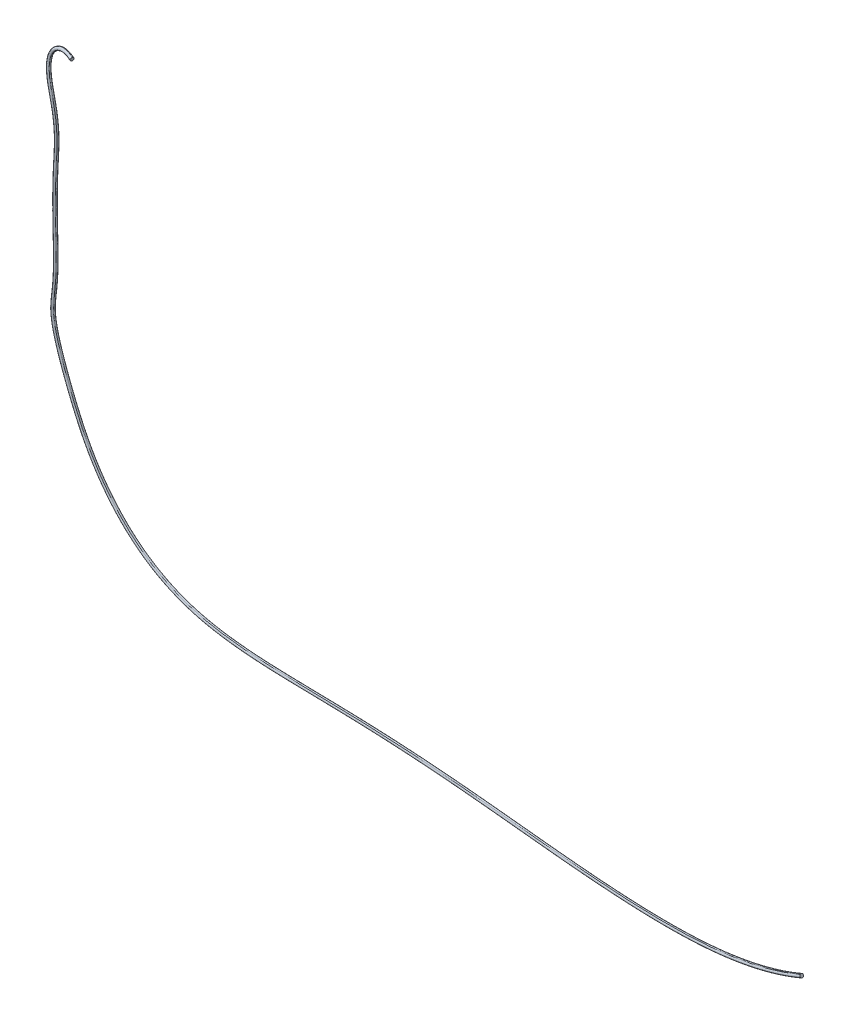
ISO-10303-21;
HEADER;
FILE_DESCRIPTION(('STEP AP214'),'2;1');
FILE_NAME('part.step','',(''),(''),'','','');
FILE_SCHEMA(('AUTOMOTIVE_DESIGN { 1 0 10303 214 1 1 1 1 }'));
ENDSEC;
DATA;
#1=APPLICATION_CONTEXT('core data for automotive mechanical design processes');
#2=APPLICATION_PROTOCOL_DEFINITION('international standard','automotive_design',2000,#1);
#3=PRODUCT_CONTEXT('',#1,'mechanical');
#4=PRODUCT('Part','Part','',(#3));
#5=PRODUCT_RELATED_PRODUCT_CATEGORY('part','',(#4));
#6=PRODUCT_DEFINITION_FORMATION('','',#4);
#7=PRODUCT_DEFINITION_CONTEXT('part definition',#1,'design');
#8=PRODUCT_DEFINITION('design','',#6,#7);
#9=PRODUCT_DEFINITION_SHAPE('','',#8);
#10=(LENGTH_UNIT() NAMED_UNIT(*) SI_UNIT(.MILLI.,.METRE.));
#11=(NAMED_UNIT(*) PLANE_ANGLE_UNIT() SI_UNIT($,.RADIAN.));
#12=(NAMED_UNIT(*) SI_UNIT($,.STERADIAN.) SOLID_ANGLE_UNIT());
#13=UNCERTAINTY_MEASURE_WITH_UNIT(LENGTH_MEASURE(1.E-05),#10,'distance_accuracy_value','');
#14=(GEOMETRIC_REPRESENTATION_CONTEXT(3) GLOBAL_UNCERTAINTY_ASSIGNED_CONTEXT((#13)) GLOBAL_UNIT_ASSIGNED_CONTEXT((#10,
#11,#12)) REPRESENTATION_CONTEXT('',''));
#15=CARTESIAN_POINT('',(0.,0.,0.));
#16=DIRECTION('',(0.,0.,1.));
#17=DIRECTION('',(1.,0.,0.));
#18=AXIS2_PLACEMENT_3D('',#15,#16,#17);
#19=CARTESIAN_POINT('',(-22.67164491039,-2.076760248952,3.80305513116));
#20=CARTESIAN_POINT('',(-22.95607167295,-2.014027692752,3.706750421331));
#21=CARTESIAN_POINT('',(-23.46844392967,-2.02623183959,3.574182860336));
#22=CARTESIAN_POINT('',(-24.03408862199,-2.531160033682,3.571536751872));
#23=CARTESIAN_POINT('',(-24.05401102016,-3.51724450732,3.605977552714));
#24=CARTESIAN_POINT('',(-23.74221789007,-4.752101948218,3.589555676561));
#25=CARTESIAN_POINT('',(-23.64083597459,-5.910531929845,3.579675558743));
#26=CARTESIAN_POINT('',(-23.74279220712,-7.209352522842,3.586840748665));
#27=CARTESIAN_POINT('',(-23.74862554347,-8.960165542116,3.592708134319));
#28=CARTESIAN_POINT('',(-23.69730884828,-10.45525250418,3.590397494064));
#29=CARTESIAN_POINT('',(-23.72172302127,-11.37035240823,3.588450071318));
#30=CARTESIAN_POINT('',(-23.78010994462,-11.99086446249,3.587492341004));
#31=CARTESIAN_POINT('',(-23.83745403419,-12.40256623798,3.587723189455));
#32=CARTESIAN_POINT('',(-23.83622269867,-12.99785602954,3.588432412043));
#33=CARTESIAN_POINT('',(-23.67091605847,-13.82444787645,3.588943682323));
#34=CARTESIAN_POINT('',(-23.22091522872,-15.09454296238,3.588379868286));
#35=CARTESIAN_POINT('',(-22.73235162434,-16.30401490197,3.587999459784));
#36=CARTESIAN_POINT('',(-22.21424490788,-17.40861278317,3.588102687776));
#37=CARTESIAN_POINT('',(-21.35286017171,-18.78205674564,3.588484438544));
#38=CARTESIAN_POINT('',(-19.89640919568,-20.3623578802,3.58846778894));
#39=CARTESIAN_POINT('',(-17.59550347406,-21.58672542901,3.588186994913));
#40=CARTESIAN_POINT('',(-14.90623070752,-21.97720202819,3.588145351308));
#41=CARTESIAN_POINT('',(-12.76873889252,-22.02462521936,3.588218505189));
#42=CARTESIAN_POINT('',(-11.56017834658,-22.04865538045,3.588262607791));
#43=CARTESIAN_POINT('',(-10.33317090661,-22.07295820868,3.588307626484));
#44=CARTESIAN_POINT('',(-8.236812459988,-22.13785565984,3.588375894807));
#45=CARTESIAN_POINT('',(-4.161177133769,-22.43001497404,3.588428890037));
#46=CARTESIAN_POINT('',(1.031748074186,-23.05646031213,3.588335469948));
#47=CARTESIAN_POINT('',(6.504269605505,-23.24818116139,3.588217498175));
#48=CARTESIAN_POINT('',(9.354727235141,-22.59186827282,3.588254799676));
#49=CARTESIAN_POINT('',(10.579136647261,-22.06811229371,3.588301979863));
#50=CARTESIAN_POINT('',(-22.6647656712,-2.07827751918,3.78174961065));
#51=CARTESIAN_POINT('',(-22.94992711645,-2.015382922944,3.685196142925));
#52=CARTESIAN_POINT('',(-23.46532689104,-2.027938551912,3.55198888539));
#53=CARTESIAN_POINT('',(-24.03091289757,-2.533756434532,3.549441751559));
#54=CARTESIAN_POINT('',(-24.05039175029,-3.516396233827,3.583780267348));
#55=CARTESIAN_POINT('',(-23.73899443894,-4.751192004521,3.56740793941));
#56=CARTESIAN_POINT('',(-23.63727654964,-5.910670701197,3.557502131695));
#57=CARTESIAN_POINT('',(-23.73936519231,-7.209740419677,3.564680007776));
#58=CARTESIAN_POINT('',(-23.74511162946,-8.960028080182,3.570541377373));
#59=CARTESIAN_POINT('',(-23.69382355444,-10.4551611806,3.568233888336));
#60=CARTESIAN_POINT('',(-23.71822626351,-11.3704722334,3.566285447746));
#61=CARTESIAN_POINT('',(-23.7766578732,-11.99131380137,3.565327194153));
#62=CARTESIAN_POINT('',(-23.8339538977,-12.40285860336,3.565559481804));
#63=CARTESIAN_POINT('',(-23.83273271403,-12.99740056786,3.566266821805));
#64=CARTESIAN_POINT('',(-23.66757927302,-13.82338834288,3.566778607334));
#65=CARTESIAN_POINT('',(-23.21765292408,-15.09331186014,3.566214381304));
#66=CARTESIAN_POINT('',(-22.7291537387,-16.30262139887,3.56583419668));
#67=CARTESIAN_POINT('',(-22.21116657602,-17.40695442166,3.565937343339));
#68=CARTESIAN_POINT('',(-21.35008485401,-18.77992379869,3.566319012379));
#69=CARTESIAN_POINT('',(-19.89420140401,-20.35957505319,3.566302325174));
#70=CARTESIAN_POINT('',(-17.59452633608,-21.58330808789,3.566021724759));
#71=CARTESIAN_POINT('',(-14.90602465761,-21.97371893581,3.56598003981));
#72=CARTESIAN_POINT('',(-12.76864251679,-22.0211344188,3.566053197157));
#73=CARTESIAN_POINT('',(-11.56008730719,-22.0451641354,3.566097301474));
#74=CARTESIAN_POINT('',(-10.33306660903,-22.06946648445,3.56614232008));
#75=CARTESIAN_POINT('',(-8.236623286719,-22.13436347391,3.566210591404));
#76=CARTESIAN_POINT('',(-4.160814768168,-22.42653700488,3.566263585155));
#77=CARTESIAN_POINT('',(1.032111219892,-23.05298262985,3.566170170229));
#78=CARTESIAN_POINT('',(6.504069578415,-23.24466014294,3.566052208966));
#79=CARTESIAN_POINT('',(9.353746364364,-22.58848103764,3.566089504875));
#80=CARTESIAN_POINT('',(10.57776083668,-22.06489399883,3.566136669844));
#81=CARTESIAN_POINT('',(-22.65572391391,-2.102286144986,3.739406507901));
#82=CARTESIAN_POINT('',(-22.93954103262,-2.039688050524,3.643308218779));
#83=CARTESIAN_POINT('',(-23.45196888145,-2.055237477646,3.511598568785));
#84=CARTESIAN_POINT('',(-24.00156128366,-2.545783708927,3.509303261196));
#85=CARTESIAN_POINT('',(-24.02244322247,-3.509098545804,3.542947066645));
#86=CARTESIAN_POINT('',(-23.71141206014,-4.745052826764,3.526877527273));
#87=CARTESIAN_POINT('',(-23.60879919661,-5.911715365266,3.516772992323));
#88=CARTESIAN_POINT('',(-23.711323521,-7.211838680627,3.524033026617));
#89=CARTESIAN_POINT('',(-23.71683365565,-8.958867633436,3.529843082395));
#90=CARTESIAN_POINT('',(-23.66567567006,-10.4546929113,3.527553199468));
#91=CARTESIAN_POINT('',(-23.69003166041,-11.37189382269,3.525595620575));
#92=CARTESIAN_POINT('',(-23.74879731543,-11.99540196741,3.524632562332));
#93=CARTESIAN_POINT('',(-23.80571585862,-12.4054422124,3.524876032812));
#94=CARTESIAN_POINT('',(-23.8045268419,-12.99354770533,3.525567039427));
#95=CARTESIAN_POINT('',(-23.64067672477,-13.81462428108,3.526082942345));
#96=CARTESIAN_POINT('',(-23.19122597661,-15.08340767276,3.52551464623));
#97=CARTESIAN_POINT('',(-22.70322489417,-16.29146261047,3.525136189324));
#98=CARTESIAN_POINT('',(-22.18620294989,-17.39359334745,3.525238499012));
#99=CARTESIAN_POINT('',(-21.32764543868,-18.76258851778,3.525619428238));
#100=CARTESIAN_POINT('',(-19.87616209779,-20.33704239279,3.52560230753));
#101=CARTESIAN_POINT('',(-17.58662495616,-21.55562172907,3.525323317776));
#102=CARTESIAN_POINT('',(-14.90460987429,-21.94554364271,3.525281255842));
#103=CARTESIAN_POINT('',(-12.76808368829,-21.99293833426,3.525354434837));
#104=CARTESIAN_POINT('',(-11.55955651415,-22.01697103469,3.525398552663));
#105=CARTESIAN_POINT('',(-10.33240530433,-22.04127621106,3.525443568987));
#106=CARTESIAN_POINT('',(-8.235168134155,-22.1061951864,3.525511860614));
#107=CARTESIAN_POINT('',(-4.157848743711,-22.39849083855,3.525564841186));
#108=CARTESIAN_POINT('',(1.035251416696,-23.02495175228,3.525471463482));
#109=CARTESIAN_POINT('',(6.502495591705,-23.2162360268,3.525353593663));
#110=CARTESIAN_POINT('',(9.346093997349,-22.56109287054,3.525390844582));
#111=CARTESIAN_POINT('',(10.566675035502,-22.03897452484,3.52543787725));
#112=CARTESIAN_POINT('',(-22.66622939134,-2.174279040754,3.723537507868));
#113=CARTESIAN_POINT('',(-22.94137851729,-2.113592740168,3.630374134295));
#114=CARTESIAN_POINT('',(-23.42567926371,-2.136373850236,3.507411771746));
#115=CARTESIAN_POINT('',(-23.92245951406,-2.570986106869,3.505451820853));
#116=CARTESIAN_POINT('',(-23.95036348209,-3.490800446454,3.537430688435));
#117=CARTESIAN_POINT('',(-23.63791032053,-4.730513695952,3.522098789187));
#118=CARTESIAN_POINT('',(-23.53415008269,-5.914510529335,3.51150913431));
#119=CARTESIAN_POINT('',(-23.63728601238,-7.216579509843,3.518969724229));
#120=CARTESIAN_POINT('',(-23.64244829702,-8.955884393093,3.524655037433));
#121=CARTESIAN_POINT('',(-23.59152921295,-10.45362832824,3.522408355163));
#122=CARTESIAN_POINT('',(-23.61579261818,-11.37578329947,3.520427631149));
#123=CARTESIAN_POINT('',(-23.67539996903,-12.00607492033,3.519452128411));
#124=CARTESIAN_POINT('',(-23.73137276045,-12.41198767815,3.519724866263));
#125=CARTESIAN_POINT('',(-23.73024300839,-12.98330259149,3.520373242425));
#126=CARTESIAN_POINT('',(-23.56979999529,-13.79165729723,3.520900024139));
#127=CARTESIAN_POINT('',(-23.12160811255,-15.05735775857,3.520321076372));
#128=CARTESIAN_POINT('',(-22.63495781088,-16.26204866723,3.519947176831));
#129=CARTESIAN_POINT('',(-22.12050133587,-17.35834821536,3.520047301095));
#130=CARTESIAN_POINT('',(-21.26855662635,-18.71695215223,3.520426308657));
#131=CARTESIAN_POINT('',(-19.82870624314,-20.27771864315,3.520408064472));
#132=CARTESIAN_POINT('',(-17.56580685077,-21.48272995116,3.520133285883));
#133=CARTESIAN_POINT('',(-14.90079114882,-21.87134534313,3.520090244241));
#134=CARTESIAN_POINT('',(-12.76653367828,-21.918669749,3.520163480777));
#135=CARTESIAN_POINT('',(-11.55808617778,-21.9427079064,3.520207634062));
#136=CARTESIAN_POINT('',(-10.33059991212,-21.96701795457,3.520252644698));
#137=CARTESIAN_POINT('',(-8.231311101068,-22.03198509773,3.520320990309));
#138=CARTESIAN_POINT('',(-4.150050283847,-22.32459982371,3.520373936684));
#139=CARTESIAN_POINT('',(1.043448045457,-22.95109682433,3.520280657338));
#140=CARTESIAN_POINT('',(6.498335490767,-23.14136126913,3.520163026255));
#141=CARTESIAN_POINT('',(9.325832068386,-22.48896444578,3.520200158133));
#142=CARTESIAN_POINT('',(10.537459721249,-21.97067601925,3.5202468458));
#143=CARTESIAN_POINT('',(-22.69306328881,-2.228147991816,3.767698812032));
#144=CARTESIAN_POINT('',(-22.95936484592,-2.169413092022,3.677531157083));
#145=CARTESIAN_POINT('',(-23.41295869552,-2.196840232214,3.563272993643));
#146=CARTESIAN_POINT('',(-23.86764596202,-2.584379440099,3.561346969225));
#147=CARTESIAN_POINT('',(-23.9022632581,-3.478718726546,3.592280652014));
#148=CARTESIAN_POINT('',(-23.58751559817,-4.721465669557,3.577415686229));
#149=CARTESIAN_POINT('',(-23.48368122541,-5.916418494834,3.566514945501));
#150=CARTESIAN_POINT('',(-23.58693479198,-7.219353008066,3.574103107841));
#151=CARTESIAN_POINT('',(-23.59202497942,-8.953885040099,3.579708405829));
#152=CARTESIAN_POINT('',(-23.54121163527,-10.45300746987,3.577489121184));
#153=CARTESIAN_POINT('',(-23.56542973727,-11.37853595596,3.575493036247));
#154=CARTESIAN_POINT('',(-23.62558924058,-12.01333231036,3.574509131863));
#155=CARTESIAN_POINT('',(-23.68094099491,-12.41634832836,3.574801689848));
#156=CARTESIAN_POINT('',(-23.67983515166,-12.97628993363,3.575421163856));
#157=CARTESIAN_POINT('',(-23.52170105276,-13.77609592501,3.575955375608));
#158=CARTESIAN_POINT('',(-23.0743511209,-15.03969986654,3.575369173018));
#159=CARTESIAN_POINT('',(-22.58863080001,-16.24208993824,3.574998379885));
#160=CARTESIAN_POINT('',(-22.07592475077,-17.33441239001,3.575097017095));
#161=CARTESIAN_POINT('',(-21.2284617186,-18.68597987287,3.575474726258));
#162=CARTESIAN_POINT('',(-19.7965020735,-20.23746481837,3.575455720138));
#163=CARTESIAN_POINT('',(-17.55167569165,-21.43326798667,3.575183796202));
#164=CARTESIAN_POINT('',(-14.89819066839,-21.82099393743,3.575140091072));
#165=CARTESIAN_POINT('',(-12.76547515804,-21.86826906639,3.575213366647));
#166=CARTESIAN_POINT('',(-11.55708237794,-21.89231070059,3.575257543977));
#167=CARTESIAN_POINT('',(-10.32936960333,-21.91662377152,3.575302550786));
#168=CARTESIAN_POINT('',(-8.228692130526,-21.98162257439,3.575370933089));
#169=CARTESIAN_POINT('',(-4.144759293007,-22.27445361058,3.575423856329));
#170=CARTESIAN_POINT('',(1.049003779901,-22.9009748848,3.575330643718));
#171=CARTESIAN_POINT('',(6.495511316382,-23.09054880507,3.575213174446));
#172=CARTESIAN_POINT('',(9.312069659925,-22.44001780397,3.575250225469));
#173=CARTESIAN_POINT('',(10.517630236508,-21.92432464292,3.575296679353));
#174=CARTESIAN_POINT('',(-22.70824732937,-2.22468128383333,3.81480162726868));
#175=CARTESIAN_POINT('',(-22.9729799494667,-2.16629242541933,3.72516520230234));
#176=CARTESIAN_POINT('',(-23.41992156906,-2.192804478578,3.61228674599634));
#177=CARTESIAN_POINT('',(-23.8749569347133,-2.57861622417633,3.61015370211101));
#178=CARTESIAN_POINT('',(-23.9104848201533,-3.480830689012,3.64132747431868));
#179=CARTESIAN_POINT('',(-23.59481632317,-4.723623146325,3.62635360793701));
#180=CARTESIAN_POINT('',(-23.4917051312767,-5.91612316087,3.61551568576101));
#181=CARTESIAN_POINT('',(-23.5946538182467,-7.21848362722267,3.62307530705501));
#182=CARTESIAN_POINT('',(-23.5999254818933,-8.954212147035,3.62869614071568));
#183=CARTESIAN_POINT('',(-23.5490437216967,-10.4532062818767,3.62647023688468));
#184=CARTESIAN_POINT('',(-23.5732867805567,-11.3782332275267,3.62447670288168));
#185=CARTESIAN_POINT('',(-23.6333430414533,-12.0122494417867,3.62349408071968));
#186=CARTESIAN_POINT('',(-23.6888093474633,-12.4156213044733,3.62378342707801));
#187=CARTESIAN_POINT('',(-23.6876828115933,-12.9773197642433,3.62440733712334));
#188=CARTESIAN_POINT('',(-23.5291919457133,-13.77852214171,3.62494040100468));
#189=CARTESIAN_POINT('',(-23.0816914097533,-15.0424679603333,3.62435522795134));
#190=CARTESIAN_POINT('',(-22.5958353727233,-16.24520625082,3.62398394237101));
#191=CARTESIAN_POINT('',(-22.08286441535,-17.3381269626233,3.62408278786101));
#192=CARTESIAN_POINT('',(-21.2347049023533,-18.69079120535,3.62446069499268));
#193=CARTESIAN_POINT('',(-19.8014997505733,-20.24373069591,3.62444179246068));
#194=CARTESIAN_POINT('',(-17.55387201389,-21.4409646546767,3.62416942233734));
#195=CARTESIAN_POINT('',(-14.89860756061,-21.8288300762367,3.62412581765601));
#196=CARTESIAN_POINT('',(-12.7656515902267,-21.8761148166967,3.62419908631101));
#197=CARTESIAN_POINT('',(-11.55724964946,-21.9001562365767,3.62424325980701));
#198=CARTESIAN_POINT('',(-10.3295710208833,-21.92446912766,3.62428826706068));
#199=CARTESIAN_POINT('',(-8.22910426111733,-21.98946416619,3.62435664318768));
#200=CARTESIAN_POINT('',(-4.14558090767633,-22.28226191556,3.62440956998901));
#201=CARTESIAN_POINT('',(1.048149549775,-22.90878024106,3.62431634638001));
#202=CARTESIAN_POINT('',(6.49595335919133,-23.09845956315,3.62419885232134));
#203=CARTESIAN_POINT('',(9.314223220627,-22.4476363325367,3.62423591580034));
#204=CARTESIAN_POINT('',(10.5207165850267,-21.93154416018,3.62428240562768));
#205=CARTESIAN_POINT('',(-22.7123421208817,-2.21382729884266,3.83396545133918));
#206=CARTESIAN_POINT('',(-22.9776690036117,-2.15530737113782,3.74412781362485));
#207=CARTESIAN_POINT('',(-23.42595517171,-2.18050891088849,3.63057937172468));
#208=CARTESIAN_POINT('',(-23.8881736558417,-2.57317452354566,3.62832876750135));
#209=CARTESIAN_POINT('',(-23.9230864149717,-3.48405867141717,3.65981279548468));
#210=CARTESIAN_POINT('',(-23.607268105765,-4.726356360004,3.64470163866435));
#211=CARTESIAN_POINT('',(-23.5045681055183,-5.915645541099,3.63395185396085));
#212=CARTESIAN_POINT('',(-23.607323571055,-7.21753673347883,3.64147442872235));
#213=CARTESIAN_POINT('',(-23.61270556389,-8.95473045523417,3.64711781393985));
#214=CARTESIAN_POINT('',(-23.561766496005,-10.453419654595,3.64488383426868));
#215=CARTESIAN_POINT('',(-23.5860308205167,-11.377601471255,3.64289434665868));
#216=CARTESIAN_POINT('',(-23.6459371278717,-12.0104262796583,3.64191386228118));
#217=CARTESIAN_POINT('',(-23.70157169412,-12.4144775856217,3.64219815495318));
#218=CARTESIAN_POINT('',(-23.70042998294,-12.97905939329,3.64282937778685));
#219=CARTESIAN_POINT('',(-23.5413542400433,-13.782468031405,3.64336058068602));
#220=CARTESIAN_POINT('',(-23.0936331150183,-15.04694394329,3.64277721536518));
#221=CARTESIAN_POINT('',(-22.6075488097383,-16.2502550334633,3.64240514712468));
#222=CARTESIAN_POINT('',(-22.0941402647917,-17.344170215735,3.64250436318035));
#223=CARTESIAN_POINT('',(-21.2448451080317,-18.6986204670367,3.64288260020118));
#224=CARTESIAN_POINT('',(-19.809641084695,-20.253911071445,3.64286388791568));
#225=CARTESIAN_POINT('',(-17.557443214405,-21.453472798865,3.64259079395935));
#226=CARTESIAN_POINT('',(-14.8992626552717,-21.8415620253433,3.64254735720368));
#227=CARTESIAN_POINT('',(-12.7659177637117,-21.8888587745017,3.64262061582968));
#228=CARTESIAN_POINT('',(-11.5575021920367,-21.91289925645,3.64266478321968));
#229=CARTESIAN_POINT('',(-10.3298810796667,-21.93721129532,3.64270979142852));
#230=CARTESIAN_POINT('',(-8.22976636731133,-22.0021980228267,3.64277815821552));
#231=CARTESIAN_POINT('',(-4.14691905065733,-22.29494102774,3.64283109089268));
#232=CARTESIAN_POINT('',(1.04674313086317,-22.9214532219817,3.64273785029218));
#233=CARTESIAN_POINT('',(6.49666730978017,-23.1113075697567,3.64262031528868));
#234=CARTESIAN_POINT('',(9.31769918127767,-22.46001325068,3.64265739915268));
#235=CARTESIAN_POINT('',(10.5257290938122,-21.9432638012183,3.64270394818802));
#236=B_SPLINE_SURFACE_WITH_KNOTS('',3,3,((#19,#20,#21,#22,#23,#24,#25,#26,#27,#28,#29,#30,#31,
#32,#33,#34,#35,#36,#37,#38,#39,#40,#41,#42,#43,#44,#45,#46,#47,#48,#49),(#50,#51,#52,#53,#54,
#55,#56,#57,#58,#59,#60,#61,#62,#63,#64,#65,#66,#67,#68,#69,#70,#71,#72,#73,#74,#75,#76,#77,#78,
#79,#80),(#81,#82,#83,#84,#85,#86,#87,#88,#89,#90,#91,#92,#93,#94,#95,#96,#97,#98,#99,#100,#101,
#102,#103,#104,#105,#106,#107,#108,#109,#110,#111),(#112,#113,#114,#115,#116,#117,#118,#119,
#120,#121,#122,#123,#124,#125,#126,#127,#128,#129,#130,#131,#132,#133,#134,#135,#136,#137,#138,
#139,#140,#141,#142),(#143,#144,#145,#146,#147,#148,#149,#150,#151,#152,#153,#154,#155,#156,
#157,#158,#159,#160,#161,#162,#163,#164,#165,#166,#167,#168,#169,#170,#171,#172,#173),(#174,
#175,#176,#177,#178,#179,#180,#181,#182,#183,#184,#185,#186,#187,#188,#189,#190,#191,#192,#193,
#194,#195,#196,#197,#198,#199,#200,#201,#202,#203,#204),(#205,#206,#207,#208,#209,#210,#211,
#212,#213,#214,#215,#216,#217,#218,#219,#220,#221,#222,#223,#224,#225,#226,#227,#228,#229,#230,
#231,#232,#233,#234,#235)),.UNSPECIFIED.,.F.,.F.,.F.,(4,1,1,1,4),(4,1,1,1,1,1,1,1,1,1,1,1,1,1,1,
1,1,1,1,1,1,1,1,1,1,1,1,1,4),(-3.14159265359,-2.243994752564,-1.346396851538,-0.448798950513,
0.448798950513),(0.,0.03571428571429,0.07142857142857,0.107142857143,0.142857142857,
0.178571428571,0.214285714286,0.25,0.285714285714,0.303571428571,0.321428571429,0.348214285714,
0.357142857143,0.392857142857,0.428571428571,0.452380952381,0.488095238095,0.52380952381,
0.571428571429,0.619047619048,0.666666666667,0.702380952381,0.708333333333,0.714285714286,0.75,
0.785714285714,0.857142857143,0.928571428571,1.),.UNSPECIFIED.);
#237=CARTESIAN_POINT('',(-22.67164491039,-2.076760248952,3.80305513116));
#238=CARTESIAN_POINT('',(-22.95607167295,-2.014027692752,3.706750421331));
#239=CARTESIAN_POINT('',(-23.46844392967,-2.02623183959,3.574182860336));
#240=CARTESIAN_POINT('',(-24.03408862199,-2.531160033682,3.571536751872));
#241=CARTESIAN_POINT('',(-24.05401102016,-3.51724450732,3.605977552714));
#242=CARTESIAN_POINT('',(-23.74221789007,-4.752101948218,3.589555676561));
#243=CARTESIAN_POINT('',(-23.64083597459,-5.910531929845,3.579675558743));
#244=CARTESIAN_POINT('',(-23.74279220712,-7.209352522842,3.586840748665));
#245=CARTESIAN_POINT('',(-23.74862554347,-8.960165542116,3.592708134319));
#246=CARTESIAN_POINT('',(-23.69730884828,-10.45525250418,3.590397494064));
#247=CARTESIAN_POINT('',(-23.72172302127,-11.37035240823,3.588450071318));
#248=CARTESIAN_POINT('',(-23.78010994462,-11.99086446249,3.587492341004));
#249=CARTESIAN_POINT('',(-23.83745403419,-12.40256623798,3.587723189455));
#250=CARTESIAN_POINT('',(-23.83622269867,-12.99785602954,3.588432412043));
#251=CARTESIAN_POINT('',(-23.67091605847,-13.82444787645,3.588943682323));
#252=CARTESIAN_POINT('',(-23.22091522872,-15.09454296238,3.588379868286));
#253=CARTESIAN_POINT('',(-22.73235162434,-16.30401490197,3.587999459784));
#254=CARTESIAN_POINT('',(-22.21424490788,-17.40861278317,3.588102687776));
#255=CARTESIAN_POINT('',(-21.35286017171,-18.78205674564,3.588484438544));
#256=CARTESIAN_POINT('',(-19.89640919568,-20.3623578802,3.58846778894));
#257=CARTESIAN_POINT('',(-17.59550347406,-21.58672542901,3.588186994913));
#258=CARTESIAN_POINT('',(-14.90623070752,-21.97720202819,3.588145351308));
#259=CARTESIAN_POINT('',(-12.76873889252,-22.02462521936,3.588218505189));
#260=CARTESIAN_POINT('',(-11.56017834658,-22.04865538045,3.588262607791));
#261=CARTESIAN_POINT('',(-10.33317090661,-22.07295820868,3.588307626484));
#262=CARTESIAN_POINT('',(-8.236812459988,-22.13785565984,3.588375894807));
#263=CARTESIAN_POINT('',(-4.161177133769,-22.43001497404,3.588428890037));
#264=CARTESIAN_POINT('',(1.031748074186,-23.05646031213,3.588335469948));
#265=CARTESIAN_POINT('',(6.504269605505,-23.24818116139,3.588217498175));
#266=CARTESIAN_POINT('',(9.354727235141,-22.59186827282,3.588254799676));
#267=CARTESIAN_POINT('',(10.579136647261,-22.06811229371,3.588301979863));
#268=B_SPLINE_CURVE_WITH_KNOTS('',3,(#237,#238,#239,#240,#241,#242,#243,#244,#245,#246,#247,
#248,#249,#250,#251,#252,#253,#254,#255,#256,#257,#258,#259,#260,#261,#262,#263,#264,#265,#266,
#267),.UNSPECIFIED.,.F.,.F.,(4,1,1,1,1,1,1,1,1,1,1,1,1,1,1,1,1,1,1,1,1,1,1,1,1,1,1,1,4),(0.,
0.03571428571429,0.07142857142857,0.107142857143,0.142857142857,0.178571428571,0.214285714286,
0.25,0.285714285714,0.303571428571,0.321428571429,0.348214285714,0.357142857143,0.392857142857,
0.428571428571,0.452380952381,0.488095238095,0.52380952381,0.571428571429,0.619047619048,
0.666666666667,0.702380952381,0.708333333333,0.714285714286,0.75,0.785714285714,0.857142857143,
0.928571428571,1.),.UNSPECIFIED.);
#269=CARTESIAN_POINT('',(-22.6716449103886,-2.0767602489523,3.80305513116046));
#270=VERTEX_POINT('',#269);
#271=CARTESIAN_POINT('',(10.5791366472605,-22.0681122937102,3.588301979863));
#272=VERTEX_POINT('',#271);
#273=EDGE_CURVE('E11',#270,#272,#268,.T.);
#274=CARTESIAN_POINT('',(-22.671644910392,-2.07676024895155,3.80305513115931));
#275=CARTESIAN_POINT('',(-22.6690569843641,-2.07733340779941,3.79503858511437));
#276=CARTESIAN_POINT('',(-22.6667910631493,-2.07939934278363,3.78700066029199));
#277=CARTESIAN_POINT('',(-22.6631212237183,-2.08602409697569,3.77184679796066));
#278=CARTESIAN_POINT('',(-22.6617157545192,-2.09057840262195,3.76472921989008));
#279=CARTESIAN_POINT('',(-22.660352685312,-2.0990145317383,3.75520825975499));
#280=CARTESIAN_POINT('',(-22.6600236931459,-2.10216066724106,3.75218723100457));
#281=CARTESIAN_POINT('',(-22.6596679100614,-2.10893466272886,3.74672390231891));
#282=CARTESIAN_POINT('',(-22.6596409252525,-2.11256221212905,3.74428123206009));
#283=CARTESIAN_POINT('',(-22.6599801295803,-2.12343483722909,3.73820064908412));
#284=CARTESIAN_POINT('',(-22.6607038515786,-2.13111135289802,3.7353376370431));
#285=CARTESIAN_POINT('',(-22.6630984673696,-2.14732387635054,3.73184912416034));
#286=CARTESIAN_POINT('',(-22.6648233548996,-2.15588383422302,3.73136748765765));
#287=CARTESIAN_POINT('',(-22.6680470549317,-2.16827065890773,3.73281964290952));
#288=CARTESIAN_POINT('',(-22.6692276023714,-2.17232387573716,3.73366602555652));
#289=CARTESIAN_POINT('',(-22.6717678112952,-2.18015627229803,3.73606629386562));
#290=CARTESIAN_POINT('',(-22.6731275799445,-2.18393528595677,3.73762060420935));
#291=CARTESIAN_POINT('',(-22.6772388700805,-2.19432796857965,3.74299314928405));
#292=CARTESIAN_POINT('',(-22.6801553679879,-2.20048396230998,3.74759675420447));
#293=CARTESIAN_POINT('',(-22.6863927450769,-2.21131225697541,3.75896473787967));
#294=CARTESIAN_POINT('',(-22.6897274794365,-2.21583435104345,3.76586788081438));
#295=CARTESIAN_POINT('',(-22.6959952321224,-2.2216828171642,3.78056941906695));
#296=CARTESIAN_POINT('',(-22.6989401639342,-2.22316529371141,3.78830131379623));
#297=CARTESIAN_POINT('',(-22.7043445461833,-2.22353153327081,3.80402407341681));
#298=CARTESIAN_POINT('',(-22.7068015857348,-2.22240272359602,3.81201600779216));
#299=CARTESIAN_POINT('',(-22.7099639456811,-2.21874200197428,3.82374031733));
#300=CARTESIAN_POINT('',(-22.7109479481715,-2.21712703785721,3.82769845677674));
#301=CARTESIAN_POINT('',(-22.7126565322436,-2.2131920564274,3.83530782999541));
#302=CARTESIAN_POINT('',(-22.7133812493234,-2.21087240854567,3.83895922330192));
#303=CARTESIAN_POINT('',(-22.7150700957683,-2.20336174826144,3.84883948819604));
#304=CARTESIAN_POINT('',(-22.7156994439288,-2.19742219818203,3.85456721034776));
#305=CARTESIAN_POINT('',(-22.7160090146291,-2.18373830826253,3.8643951365794));
#306=CARTESIAN_POINT('',(-22.7156316240257,-2.17590878485806,3.86838067402234));
#307=CARTESIAN_POINT('',(-22.7142267931339,-2.16367170613735,3.87220283111291));
#308=CARTESIAN_POINT('',(-22.7136245290144,-2.15953564181863,3.87311831962931));
#309=CARTESIAN_POINT('',(-22.7121624861408,-2.15121139234483,3.87422270306793));
#310=CARTESIAN_POINT('',(-22.7113025253994,-2.14702317236707,3.8744110831912));
#311=CARTESIAN_POINT('',(-22.7085094813304,-2.13502774930132,3.8739758715147));
#312=CARTESIAN_POINT('',(-22.7063010128511,-2.12730469367546,3.87248414263551));
#313=CARTESIAN_POINT('',(-22.7011268266288,-2.11224381722359,3.8670132808566));
#314=CARTESIAN_POINT('',(-22.6981134551021,-2.10499124433281,3.86283787684491));
#315=CARTESIAN_POINT('',(-22.6919312061816,-2.09302079566788,3.85237670413136));
#316=CARTESIAN_POINT('',(-22.6887766194361,-2.08819844700267,3.84620119477558));
#317=CARTESIAN_POINT('',(-22.6825307169554,-2.08088287090428,3.83251985940018));
#318=CARTESIAN_POINT('',(-22.6794399165469,-2.07840431100242,3.82500600096965));
#319=CARTESIAN_POINT('',(-22.6748336912695,-2.07660612151229,3.81257328899595));
#320=CARTESIAN_POINT('',(-22.6731824689559,-2.07641971939797,3.80781798330075));
#321=CARTESIAN_POINT('',(-22.671644910392,-2.07676024895155,3.80305513115931));
#322=B_SPLINE_CURVE_WITH_KNOTS('',3,(#274,#275,#276,#277,#278,#279,#280,#281,#282,#283,#284,
#285,#286,#287,#288,#289,#290,#291,#292,#293,#294,#295,#296,#297,#298,#299,#300,#301,#302,#303,
#304,#305,#306,#307,#308,#309,#310,#311,#312,#313,#314,#315,#316,#317,#318,#319,#320,#321),
.UNSPECIFIED.,.T.,.F.,(4,2,2,2,2,2,2,2,2,2,2,2,2,2,2,2,2,2,2,2,2,2,2,4),(0.,0.0252781468673808,
0.0505105941444672,0.0635691326386559,0.0766192869867806,0.100876105381445,0.126581816495082,
0.13943328818076,0.152292479563436,0.176553796720393,0.202677880973782,0.227422832252827,
0.252287172061896,0.265383304272354,0.278472582638774,0.302879199911088,0.328712065216855,
0.341482877938606,0.354262730848094,0.378375038820849,0.404489670634637,0.429357648828761,
0.454380241606411,0.46939868911034),.UNSPECIFIED.);
#323=CARTESIAN_POINT('',(-22.7123421208828,-2.21382729884242,3.83396545133882));
#324=VERTEX_POINT('',#323);
#325=EDGE_CURVE('E47',#270,#324,#322,.T.);
#326=CARTESIAN_POINT('',(-22.7123421208817,-2.21382729884266,3.83396545133918));
#327=CARTESIAN_POINT('',(-22.9776690036117,-2.15530737113782,3.74412781362485));
#328=CARTESIAN_POINT('',(-23.42595517171,-2.18050891088849,3.63057937172468));
#329=CARTESIAN_POINT('',(-23.8881736558417,-2.57317452354566,3.62832876750135));
#330=CARTESIAN_POINT('',(-23.9230864149717,-3.48405867141717,3.65981279548468));
#331=CARTESIAN_POINT('',(-23.607268105765,-4.726356360004,3.64470163866435));
#332=CARTESIAN_POINT('',(-23.5045681055183,-5.915645541099,3.63395185396085));
#333=CARTESIAN_POINT('',(-23.607323571055,-7.21753673347883,3.64147442872235));
#334=CARTESIAN_POINT('',(-23.61270556389,-8.95473045523417,3.64711781393985));
#335=CARTESIAN_POINT('',(-23.561766496005,-10.453419654595,3.64488383426868));
#336=CARTESIAN_POINT('',(-23.5860308205167,-11.377601471255,3.64289434665868));
#337=CARTESIAN_POINT('',(-23.6459371278717,-12.0104262796583,3.64191386228118));
#338=CARTESIAN_POINT('',(-23.70157169412,-12.4144775856217,3.64219815495318));
#339=CARTESIAN_POINT('',(-23.70042998294,-12.97905939329,3.64282937778685));
#340=CARTESIAN_POINT('',(-23.5413542400433,-13.782468031405,3.64336058068602));
#341=CARTESIAN_POINT('',(-23.0936331150183,-15.04694394329,3.64277721536518));
#342=CARTESIAN_POINT('',(-22.6075488097383,-16.2502550334633,3.64240514712468));
#343=CARTESIAN_POINT('',(-22.0941402647917,-17.344170215735,3.64250436318035));
#344=CARTESIAN_POINT('',(-21.2448451080317,-18.6986204670367,3.64288260020118));
#345=CARTESIAN_POINT('',(-19.809641084695,-20.253911071445,3.64286388791568));
#346=CARTESIAN_POINT('',(-17.557443214405,-21.453472798865,3.64259079395935));
#347=CARTESIAN_POINT('',(-14.8992626552717,-21.8415620253433,3.64254735720368));
#348=CARTESIAN_POINT('',(-12.7659177637117,-21.8888587745017,3.64262061582968));
#349=CARTESIAN_POINT('',(-11.5575021920367,-21.91289925645,3.64266478321968));
#350=CARTESIAN_POINT('',(-10.3298810796667,-21.93721129532,3.64270979142852));
#351=CARTESIAN_POINT('',(-8.22976636731133,-22.0021980228267,3.64277815821552));
#352=CARTESIAN_POINT('',(-4.14691905065733,-22.29494102774,3.64283109089268));
#353=CARTESIAN_POINT('',(1.04674313086317,-22.9214532219817,3.64273785029218));
#354=CARTESIAN_POINT('',(6.49666730978017,-23.1113075697567,3.64262031528868));
#355=CARTESIAN_POINT('',(9.31769918127767,-22.46001325068,3.64265739915268));
#356=CARTESIAN_POINT('',(10.5257290938122,-21.9432638012183,3.64270394818802));
#357=B_SPLINE_CURVE_WITH_KNOTS('',3,(#326,#327,#328,#329,#330,#331,#332,#333,#334,#335,#336,
#337,#338,#339,#340,#341,#342,#343,#344,#345,#346,#347,#348,#349,#350,#351,#352,#353,#354,#355,
#356),.UNSPECIFIED.,.F.,.F.,(4,1,1,1,1,1,1,1,1,1,1,1,1,1,1,1,1,1,1,1,1,1,1,1,1,1,1,1,4),(0.,
0.03571428571429,0.07142857142857,0.107142857143,0.142857142857,0.178571428571,0.214285714286,
0.25,0.285714285714,0.303571428571,0.321428571429,0.348214285714,0.357142857143,0.392857142857,
0.428571428571,0.452380952381,0.488095238095,0.52380952381,0.571428571429,0.619047619048,
0.666666666667,0.702380952381,0.708333333333,0.714285714286,0.75,0.785714285714,0.857142857143,
0.928571428571,1.),.UNSPECIFIED.);
#358=CARTESIAN_POINT('',(10.5257290938124,-21.9432638012182,3.64270394818801));
#359=VERTEX_POINT('',#358);
#360=EDGE_CURVE('E29',#324,#359,#357,.T.);
#361=CARTESIAN_POINT('',(10.5791366472617,-22.0681122937097,3.588301979863));
#362=CARTESIAN_POINT('',(10.5796529655039,-22.0693200662152,3.59663505715971));
#363=CARTESIAN_POINT('',(10.5795783868915,-22.069146494308,3.6052282450295));
#364=CARTESIAN_POINT('',(10.5783520260328,-22.0662810704335,3.62186425067081));
#365=CARTESIAN_POINT('',(10.5772021830185,-22.0635937519885,3.6299080312781));
#366=CARTESIAN_POINT('',(10.5747333778034,-22.0578233111012,3.64104458911413));
#367=CARTESIAN_POINT('',(10.573763479422,-22.055556258395,3.64465408157952));
#368=CARTESIAN_POINT('',(10.5715792738192,-22.0504507402863,3.65135737334516));
#369=CARTESIAN_POINT('',(10.5703651165643,-22.0476126254962,3.65445148694985));
#370=CARTESIAN_POINT('',(10.5666028607748,-22.0388181426985,3.6624729141239));
#371=CARTESIAN_POINT('',(10.5638096477807,-22.0322886930743,3.66666955833956));
#372=CARTESIAN_POINT('',(10.5576681652842,-22.0179320160756,3.67289156456359));
#373=CARTESIAN_POINT('',(10.5542966476432,-22.0100504273181,3.67477153788876));
#374=CARTESIAN_POINT('',(10.5492270186448,-21.9981989560578,3.6752489754738));
#375=CARTESIAN_POINT('',(10.5475399948089,-21.9942550992498,3.67502171875177));
#376=CARTESIAN_POINT('',(10.5442098970089,-21.9864700595677,3.67379256556682));
#377=CARTESIAN_POINT('',(10.5425668492155,-21.9826289378331,3.67279021799647));
#378=CARTESIAN_POINT('',(10.5379650418333,-21.9718707235396,3.66891597565558));
#379=CARTESIAN_POINT('',(10.5351150640682,-21.9652078572154,3.66517549811717));
#380=CARTESIAN_POINT('',(10.5297805400019,-21.9527361911826,3.65525228180586));
#381=CARTESIAN_POINT('',(10.5273458620743,-21.9470439552367,3.64889281200743));
#382=CARTESIAN_POINT('',(10.5236225113025,-21.9383384201149,3.63468468833097));
#383=CARTESIAN_POINT('',(10.5222900016634,-21.9352226482104,3.62690979689929));
#384=CARTESIAN_POINT('',(10.5206492654629,-21.931385557025,3.61066136751282));
#385=CARTESIAN_POINT('',(10.5203452620798,-21.9306741102235,3.60218509505614));
#386=CARTESIAN_POINT('',(10.5207161790778,-21.9315400758829,3.58947695892492));
#387=CARTESIAN_POINT('',(10.5209920599626,-21.9321846266106,3.58515618481543));
#388=CARTESIAN_POINT('',(10.5218553568129,-21.9342020371428,3.57672128088032));
#389=CARTESIAN_POINT('',(10.5224425959891,-21.9355744836482,3.57260703523754));
#390=CARTESIAN_POINT('',(10.5245119036156,-21.9404109890979,3.56135047646492));
#391=CARTESIAN_POINT('',(10.5263304738312,-21.9446617396174,3.55460000208666));
#392=CARTESIAN_POINT('',(10.5308324429873,-21.9551851101451,3.5424089995738));
#393=CARTESIAN_POINT('',(10.5335649070375,-21.9615724424158,3.53708400951082));
#394=CARTESIAN_POINT('',(10.5380693436316,-21.9721021470038,3.53117419357287));
#395=CARTESIAN_POINT('',(10.5396374642309,-21.975767871327,3.52955085847253));
#396=CARTESIAN_POINT('',(10.5428632722039,-21.9833087714635,3.52704748294528));
#397=CARTESIAN_POINT('',(10.5445210184934,-21.9871840850517,3.52616793793016));
#398=CARTESIAN_POINT('',(10.5493632279931,-21.9985038140877,3.5246604677862));
#399=CARTESIAN_POINT('',(10.5525965513032,-22.0060625346933,3.52494910419472));
#400=CARTESIAN_POINT('',(10.5591162904331,-22.0213043319047,3.52818067237841));
#401=CARTESIAN_POINT('',(10.5623882669382,-22.0289536709465,3.53132246040759));
#402=CARTESIAN_POINT('',(10.5681050963499,-22.0423189736347,3.5401705919145));
#403=CARTESIAN_POINT('',(10.5705838898539,-22.0481142691801,3.54573639928262));
#404=CARTESIAN_POINT('',(10.5747527114035,-22.0578610825727,3.55861148980396));
#405=CARTESIAN_POINT('',(10.5764351264618,-22.0617948046037,3.56593662974034));
#406=CARTESIAN_POINT('',(10.5783098091575,-22.0661784670024,3.57844731406461));
#407=CARTESIAN_POINT('',(10.5788284785961,-22.0673914250459,3.58332831613952));
#408=CARTESIAN_POINT('',(10.5791366472617,-22.0681122937097,3.588301979863));
#409=B_SPLINE_CURVE_WITH_KNOTS('',3,(#361,#362,#363,#364,#365,#366,#367,#368,#369,#370,#371,
#372,#373,#374,#375,#376,#377,#378,#379,#380,#381,#382,#383,#384,#385,#386,#387,#388,#389,#390,
#391,#392,#393,#394,#395,#396,#397,#398,#399,#400,#401,#402,#403,#404,#405,#406,#407,#408),
.UNSPECIFIED.,.T.,.F.,(4,2,2,2,2,2,2,2,2,2,2,2,2,2,2,2,2,2,2,2,2,2,2,4),(0.,0.0252555114411124,
0.0504655624019413,0.0635162364303464,0.0765589221151695,0.100888325194273,0.126677527308327,
0.13949796466243,0.152325869207716,0.176395201922656,0.20245953444407,0.227429182901352,
0.252501236298986,0.265567937418492,0.278627227197092,0.302764329852708,0.328490932641847,
0.341339993473594,0.354197605876277,0.378469680702751,0.404575247845206,0.429335215069363,
0.454327320278864,0.469401273945689),.UNSPECIFIED.);
#410=EDGE_CURVE('E48',#359,#272,#409,.T.);
#411=ORIENTED_EDGE('',*,*,#273,.F.);
#412=ORIENTED_EDGE('',*,*,#325,.T.);
#413=ORIENTED_EDGE('',*,*,#360,.T.);
#414=ORIENTED_EDGE('',*,*,#410,.T.);
#415=EDGE_LOOP('',(#411,#412,#413,#414));
#416=FACE_BOUND('',#415,.T.);
#417=ADVANCED_FACE('F17',(#416),#236,.T.);
#418=CARTESIAN_POINT('',(-22.68779851266,-2.15,3.80305513116));
#419=DIRECTION('',(-0.927162606687474,0.204492994284105,-0.313930113320161));
#420=DIRECTION('',(-0.320707290969048,0.,0.94717835359519));
#421=AXIS2_PLACEMENT_3D('',#418,#419,#420);
#422=PLANE('',#421);
#423=ORIENTED_EDGE('',*,*,#325,.F.);
#424=EDGE_CURVE('E50',#324,#270,#322,.T.);
#425=ORIENTED_EDGE('',*,*,#424,.F.);
#426=EDGE_LOOP('',(#423,#425));
#427=FACE_BOUND('',#426,.T.);
#428=ADVANCED_FACE('F54',(#427),#422,.F.);
#429=CARTESIAN_POINT('',(10.550000476837,-22.00000032782,3.6));
#430=DIRECTION('',(0.919414222710807,0.393290586998918,3.54278025473318E-05));
#431=DIRECTION('',(-0.393290587245733,0.919414223287799,0.));
#432=AXIS2_PLACEMENT_3D('',#429,#430,#431);
#433=PLANE('',#432);
#434=EDGE_CURVE('E56',#272,#359,#409,.T.);
#435=ORIENTED_EDGE('',*,*,#434,.F.);
#436=ORIENTED_EDGE('',*,*,#410,.F.);
#437=EDGE_LOOP('',(#435,#436));
#438=FACE_BOUND('',#437,.T.);
#439=ADVANCED_FACE('F84',(#438),#433,.T.);
#440=CARTESIAN_POINT('',(-22.7123421208817,-2.21382729884266,3.83396545133918));
#441=CARTESIAN_POINT('',(-22.9776690036117,-2.15530737113782,3.74412781362485));
#442=CARTESIAN_POINT('',(-23.42595517171,-2.18050891088849,3.63057937172468));
#443=CARTESIAN_POINT('',(-23.8881736558417,-2.57317452354566,3.62832876750135));
#444=CARTESIAN_POINT('',(-23.9230864149717,-3.48405867141717,3.65981279548468));
#445=CARTESIAN_POINT('',(-23.607268105765,-4.726356360004,3.64470163866435));
#446=CARTESIAN_POINT('',(-23.5045681055183,-5.915645541099,3.63395185396085));
#447=CARTESIAN_POINT('',(-23.607323571055,-7.21753673347883,3.64147442872235));
#448=CARTESIAN_POINT('',(-23.61270556389,-8.95473045523417,3.64711781393985));
#449=CARTESIAN_POINT('',(-23.561766496005,-10.453419654595,3.64488383426868));
#450=CARTESIAN_POINT('',(-23.5860308205167,-11.377601471255,3.64289434665868));
#451=CARTESIAN_POINT('',(-23.6459371278717,-12.0104262796583,3.64191386228118));
#452=CARTESIAN_POINT('',(-23.70157169412,-12.4144775856217,3.64219815495318));
#453=CARTESIAN_POINT('',(-23.70042998294,-12.97905939329,3.64282937778685));
#454=CARTESIAN_POINT('',(-23.5413542400433,-13.782468031405,3.64336058068602));
#455=CARTESIAN_POINT('',(-23.0936331150183,-15.04694394329,3.64277721536518));
#456=CARTESIAN_POINT('',(-22.6075488097383,-16.2502550334633,3.64240514712468));
#457=CARTESIAN_POINT('',(-22.0941402647917,-17.344170215735,3.64250436318035));
#458=CARTESIAN_POINT('',(-21.2448451080317,-18.6986204670367,3.64288260020118));
#459=CARTESIAN_POINT('',(-19.809641084695,-20.253911071445,3.64286388791568));
#460=CARTESIAN_POINT('',(-17.557443214405,-21.453472798865,3.64259079395935));
#461=CARTESIAN_POINT('',(-14.8992626552717,-21.8415620253433,3.64254735720368));
#462=CARTESIAN_POINT('',(-12.7659177637117,-21.8888587745017,3.64262061582968));
#463=CARTESIAN_POINT('',(-11.5575021920367,-21.91289925645,3.64266478321968));
#464=CARTESIAN_POINT('',(-10.3298810796667,-21.93721129532,3.64270979142852));
#465=CARTESIAN_POINT('',(-8.22976636731133,-22.0021980228267,3.64277815821552));
#466=CARTESIAN_POINT('',(-4.14691905065733,-22.29494102774,3.64283109089268));
#467=CARTESIAN_POINT('',(1.04674313086317,-22.9214532219817,3.64273785029218));
#468=CARTESIAN_POINT('',(6.49666730978017,-23.1113075697567,3.64262031528868));
#469=CARTESIAN_POINT('',(9.31769918127767,-22.46001325068,3.64265739915268));
#470=CARTESIAN_POINT('',(10.5257290938122,-21.9432638012183,3.64270394818802));
#471=CARTESIAN_POINT('',(-22.7164369123933,-2.20297331385199,3.85312927540967));
#472=CARTESIAN_POINT('',(-22.9823580577567,-2.14432231685633,3.76309042494734));
#473=CARTESIAN_POINT('',(-23.43198877436,-2.16821334319899,3.648871997453));
#474=CARTESIAN_POINT('',(-23.90139037697,-2.567732822915,3.64650383289167));
#475=CARTESIAN_POINT('',(-23.93568800979,-3.48728665382234,3.67829811665067));
#476=CARTESIAN_POINT('',(-23.61971988836,-4.729089573683,3.66304966939167));
#477=CARTESIAN_POINT('',(-23.51743107976,-5.915167921328,3.65238802216067));
#478=CARTESIAN_POINT('',(-23.6199933238633,-7.216589839735,3.65987355038967));
#479=CARTESIAN_POINT('',(-23.6254856458867,-8.95524876343334,3.665539487164));
#480=CARTESIAN_POINT('',(-23.5744892703133,-10.4536330273133,3.66329743165267));
#481=CARTESIAN_POINT('',(-23.5987748604767,-11.3769697149833,3.66131199043567));
#482=CARTESIAN_POINT('',(-23.65853121429,-12.00860311753,3.66033364384267));
#483=CARTESIAN_POINT('',(-23.7143340407767,-12.41333386677,3.66061288282834));
#484=CARTESIAN_POINT('',(-23.7131771542867,-12.9807990223367,3.66125141845034));
#485=CARTESIAN_POINT('',(-23.5535165343733,-13.7864139211,3.66178076036734));
#486=CARTESIAN_POINT('',(-23.1055748202833,-15.0514199262467,3.661199202779));
#487=CARTESIAN_POINT('',(-22.6192622467533,-16.2553038161067,3.66082635187834));
#488=CARTESIAN_POINT('',(-22.1054161142333,-17.3502134688467,3.66092593849967));
#489=CARTESIAN_POINT('',(-21.25498531371,-18.7064497287233,3.66130450540967));
#490=CARTESIAN_POINT('',(-19.8177824188167,-20.26409144698,3.66128598337067));
#491=CARTESIAN_POINT('',(-17.56101441492,-21.4659809430533,3.66101216558134));
#492=CARTESIAN_POINT('',(-14.8999177499333,-21.85429397445,3.66096889675134));
#493=CARTESIAN_POINT('',(-12.7661839371967,-21.9016027323067,3.66104214534834));
#494=CARTESIAN_POINT('',(-11.5577547346133,-21.9256422763233,3.66108630663234));
#495=CARTESIAN_POINT('',(-10.33019113845,-21.94995346298,3.66113131579634));
#496=CARTESIAN_POINT('',(-8.23042847350533,-22.0149318794633,3.66119967324334));
#497=CARTESIAN_POINT('',(-4.14825719363833,-22.30762013992,3.66125261179634));
#498=CARTESIAN_POINT('',(1.04533671195133,-22.9341262029033,3.66115935420434));
#499=CARTESIAN_POINT('',(6.497381260369,-23.1241555763633,3.661041778256));
#500=CARTESIAN_POINT('',(9.32117514192834,-22.4723901688233,3.661078882505));
#501=CARTESIAN_POINT('',(10.5307416025977,-21.9549834422567,3.66112549074834));
#502=CARTESIAN_POINT('',(-22.71763203788,-2.163024081872,3.882681756455));
#503=CARTESIAN_POINT('',(-22.98749917079,-2.103502766333,3.791306825018));
#504=CARTESIAN_POINT('',(-23.44916031142,-2.123066826077,3.673028748013));
#505=CARTESIAN_POINT('',(-23.94694628879,-2.551729236315,3.670397361567));
#506=CARTESIAN_POINT('',(-23.97787282701,-3.498086620977,3.70319257901));
#507=CARTESIAN_POINT('',(-23.66222629374,-4.737864951631,3.687503870593));
#508=CARTESIAN_POINT('',(-23.56085907086,-5.913552776208,3.6771319547));
#509=CARTESIAN_POINT('',(-23.66295330883,-7.213671645603,3.684497837845));
#510=CARTESIAN_POINT('',(-23.6687054714,-8.956994889294,3.690238445174));
#511=CARTESIAN_POINT('',(-23.61754828112,-10.45428770618,3.687970705488));
#512=CARTESIAN_POINT('',(-23.64189397703,-11.37474541833,3.685998898909));
#513=CARTESIAN_POINT('',(-23.70115375909,-12.00239333759,3.685027821232));
#514=CARTESIAN_POINT('',(-23.75751507485,-12.40948601525,3.685290057099));
#515=CARTESIAN_POINT('',(-23.75631817974,-12.98672770791,3.685953407837));
#516=CARTESIAN_POINT('',(-23.59467481874,-13.79977126318,3.686476453696));
#517=CARTESIAN_POINT('',(-23.14600135249,-15.06655576428,3.685901097501));
#518=CARTESIAN_POINT('',(-22.6589114221,-16.2723826341,3.685525608407));
#519=CARTESIAN_POINT('',(-22.14357984742,-17.37067190868,3.685626469011));
#520=CARTESIAN_POINT('',(-21.28930295267,-18.73295544299,3.686006157509));
#521=CARTESIAN_POINT('',(-19.84535007823,-20.29854707158,3.685988292868));
#522=CARTESIAN_POINT('',(-17.57310289474,-21.5083168518,3.685712025934));
#523=CARTESIAN_POINT('',(-14.90212123636,-21.89738563207,3.685669328358));
#524=CARTESIAN_POINT('',(-12.76707219895,-21.94473281322,3.685742543759));
#525=CARTESIAN_POINT('',(-11.5585976334,-21.96876881983,3.685786684453));
#526=CARTESIAN_POINT('',(-10.33122995603,-21.99307677748,3.685831696993));
#527=CARTESIAN_POINT('',(-8.23266476769,-22.05802571421,3.685900023256));
#528=CARTESIAN_POINT('',(-4.152788150893,-22.35052828366,3.685952981751));
#529=CARTESIAN_POINT('',(1.04056526643,-22.97701277033,3.685859667191));
#530=CARTESIAN_POINT('',(6.499795019915,-23.16763684471,3.68574195225));
#531=CARTESIAN_POINT('',(9.332925423829,-22.51427931283,3.685779125583));
#532=CARTESIAN_POINT('',(10.547705289221,-21.99464248915,3.685825934715));
#533=CARTESIAN_POINT('',(-22.69680905691,-2.093219491914,3.866653540356));
#534=CARTESIAN_POINT('',(-22.97638138785,-2.031557618732,3.771992503661));
#535=CARTESIAN_POINT('',(-23.47070923899,-2.044570267785,3.644033206084));
#536=CARTESIAN_POINT('',(-24.02111851323,-2.530327317122,3.641189756312));
#537=CARTESIAN_POINT('',(-24.04444587046,-3.514882570632,3.675483944783));
#538=CARTESIAN_POINT('',(-23.7308833606,-4.750913067312,3.659124877445));
#539=CARTESIAN_POINT('',(-23.63020320655,-5.910940677,3.64919213441));
#540=CARTESIAN_POINT('',(-23.73189770124,-7.209505996522,3.656375801832));
#541=CARTESIAN_POINT('',(-23.73788804144,-8.95975286819,3.662228916386));
#542=CARTESIAN_POINT('',(-23.68654240773,-10.45522237529,3.659921677123));
#543=CARTESIAN_POINT('',(-23.71096500159,-11.37106876381,3.657971100161));
#544=CARTESIAN_POINT('',(-23.76945283652,-11.99246685771,3.657011536467));
#545=CARTESIAN_POINT('',(-23.82668189951,-12.40345335022,3.65724647493));
#546=CARTESIAN_POINT('',(-23.82543855585,-12.99629335682,3.657949443626));
#547=CARTESIAN_POINT('',(-23.66062909406,-13.82112070535,3.658462301891));
#548=CARTESIAN_POINT('',(-23.21078820249,-15.09078446284,3.657896823396));
#549=CARTESIAN_POINT('',(-22.72243234677,-16.2997547939,3.657517064899));
#550=CARTESIAN_POINT('',(-22.20470760807,-17.40348075031,3.657619948125));
#551=CARTESIAN_POINT('',(-21.34428347175,-18.77541958069,3.658001415412));
#552=CARTESIAN_POINT('',(-19.88950234291,-20.35374493443,3.657984584917));
#553=CARTESIAN_POINT('',(-17.59247669182,-21.57613962568,3.657704399105));
#554=CARTESIAN_POINT('',(-14.90568819642,-21.96642725999,3.657662610186));
#555=CARTESIAN_POINT('',(-12.76852562562,-22.01384214512,3.657735771407));
#556=CARTESIAN_POINT('',(-11.55997603606,-22.03787342364,3.657779879042));
#557=CARTESIAN_POINT('',(-10.33291885439,-22.0621772374,3.657824896734));
#558=CARTESIAN_POINT('',(-8.236257084533,-22.12708281019,3.65789317234));
#559=CARTESIAN_POINT('',(-4.160042843574,-22.41928884032,3.657946162571));
#560=CARTESIAN_POINT('',(1.032948787612,-23.04574029079,3.657852756027));
#561=CARTESIAN_POINT('',(6.503668083939,-23.23731100662,3.657734819342));
#562=CARTESIAN_POINT('',(9.351795962323,-22.58139519986,3.657772103383));
#563=CARTESIAN_POINT('',(10.574893949635,-22.05820019862,3.657819233037));
#564=CARTESIAN_POINT('',(-22.67852414958,-2.075242978724,3.824360651671));
#565=CARTESIAN_POINT('',(-22.96227494804,-2.012659511714,3.728284818075));
#566=CARTESIAN_POINT('',(-23.47162527894,-2.024354593708,3.59632873381));
#567=CARTESIAN_POINT('',(-24.03749238215,-2.528596668865,3.593602220513));
#568=CARTESIAN_POINT('',(-24.05777791899,-3.518346467452,3.628159532897));
#569=CARTESIAN_POINT('',(-23.74552673064,-4.753160499555,3.611691743387));
#570=CARTESIAN_POINT('',(-23.6444490771,-5.910413225945,3.60184436106));
#571=CARTESIAN_POINT('',(-23.74625893226,-7.208961161011,3.608996883478));
#572=CARTESIAN_POINT('',(-23.7521631489,-8.96032576583,3.614873110857));
#573=CARTESIAN_POINT('',(-23.70081121955,-10.45533815874,3.612559999273));
#574=CARTESIAN_POINT('',(-23.7252359391,-11.37019416536,3.610613953585));
#575=CARTESIAN_POINT('',(-23.78357434025,-11.99032727797,3.609656888105));
#576=CARTESIAN_POINT('',(-23.84097436945,-12.4021891589,3.60988636627));
#577=CARTESIAN_POINT('',(-23.83973514938,-12.99832042302,3.610597721182));
#578=CARTESIAN_POINT('',(-23.6742597062,-13.82556593287,3.611108507992));
#579=CARTESIAN_POINT('',(-23.22420354596,-15.09578188109,3.610545247589));
#580=CARTESIAN_POINT('',(-22.73558596765,-16.30539703666,3.610164638358));
#581=CARTESIAN_POINT('',(-22.21736364576,-17.41026437637,3.610267983194));
#582=CARTESIAN_POINT('',(-21.35565609367,-18.78422095784,3.61064983515));
#583=CARTESIAN_POINT('',(-19.89867003676,-20.36516815477,3.61063325034));
#584=CARTESIAN_POINT('',(-17.59648569044,-21.5901789352,3.61035225113));
#585=CARTESIAN_POINT('',(-14.90638325678,-21.98071179641,3.610310658468));
#586=CARTESIAN_POINT('',(-12.76878835369,-22.02813363026,3.61038381018));
#587=CARTESIAN_POINT('',(-11.56022578938,-22.05216280608,3.610427911124));
#588=CARTESIAN_POINT('',(-10.33323680577,-22.07646463203,3.610472930245));
#589=CARTESIAN_POINT('',(-8.236987206181,-22.14135687835,3.610541196396));
#590=CARTESIAN_POINT('',(-4.16154980289,-22.4335003302,3.610594193395));
#591=CARTESIAN_POINT('',(1.031338205808,-23.05994266386,3.610500769043));
#592=CARTESIAN_POINT('',(6.504461760471,-23.25171651207,3.610382785284));
#593=CARTESIAN_POINT('',(9.355652833643,-22.59527915138,3.610420092347));
#594=CARTESIAN_POINT('',(10.580512457842,-22.0713305886,3.610467289882));
#595=CARTESIAN_POINT('',(-22.67164491039,-2.076760248952,3.80305513116));
#596=CARTESIAN_POINT('',(-22.95607167295,-2.014027692752,3.706750421331));
#597=CARTESIAN_POINT('',(-23.46844392967,-2.02623183959,3.574182860336));
#598=CARTESIAN_POINT('',(-24.03408862199,-2.531160033682,3.571536751872));
#599=CARTESIAN_POINT('',(-24.05401102016,-3.51724450732,3.605977552714));
#600=CARTESIAN_POINT('',(-23.74221789007,-4.752101948218,3.589555676561));
#601=CARTESIAN_POINT('',(-23.64083597459,-5.910531929845,3.579675558743));
#602=CARTESIAN_POINT('',(-23.74279220712,-7.209352522842,3.586840748665));
#603=CARTESIAN_POINT('',(-23.74862554347,-8.960165542116,3.592708134319));
#604=CARTESIAN_POINT('',(-23.69730884828,-10.45525250418,3.590397494064));
#605=CARTESIAN_POINT('',(-23.72172302127,-11.37035240823,3.588450071318));
#606=CARTESIAN_POINT('',(-23.78010994462,-11.99086446249,3.587492341004));
#607=CARTESIAN_POINT('',(-23.83745403419,-12.40256623798,3.587723189455));
#608=CARTESIAN_POINT('',(-23.83622269867,-12.99785602954,3.588432412043));
#609=CARTESIAN_POINT('',(-23.67091605847,-13.82444787645,3.588943682323));
#610=CARTESIAN_POINT('',(-23.22091522872,-15.09454296238,3.588379868286));
#611=CARTESIAN_POINT('',(-22.73235162434,-16.30401490197,3.587999459784));
#612=CARTESIAN_POINT('',(-22.21424490788,-17.40861278317,3.588102687776));
#613=CARTESIAN_POINT('',(-21.35286017171,-18.78205674564,3.588484438544));
#614=CARTESIAN_POINT('',(-19.89640919568,-20.3623578802,3.58846778894));
#615=CARTESIAN_POINT('',(-17.59550347406,-21.58672542901,3.588186994913));
#616=CARTESIAN_POINT('',(-14.90623070752,-21.97720202819,3.588145351308));
#617=CARTESIAN_POINT('',(-12.76873889252,-22.02462521936,3.588218505189));
#618=CARTESIAN_POINT('',(-11.56017834658,-22.04865538045,3.588262607791));
#619=CARTESIAN_POINT('',(-10.33317090661,-22.07295820868,3.588307626484));
#620=CARTESIAN_POINT('',(-8.236812459988,-22.13785565984,3.588375894807));
#621=CARTESIAN_POINT('',(-4.161177133769,-22.43001497404,3.588428890037));
#622=CARTESIAN_POINT('',(1.031748074186,-23.05646031213,3.588335469948));
#623=CARTESIAN_POINT('',(6.504269605505,-23.24818116139,3.588217498175));
#624=CARTESIAN_POINT('',(9.354727235141,-22.59186827282,3.588254799676));
#625=CARTESIAN_POINT('',(10.579136647261,-22.06811229371,3.588301979863));
#626=B_SPLINE_SURFACE_WITH_KNOTS('',3,3,((#440,#441,#442,#443,#444,#445,#446,#447,#448,#449,
#450,#451,#452,#453,#454,#455,#456,#457,#458,#459,#460,#461,#462,#463,#464,#465,#466,#467,#468,
#469,#470),(#471,#472,#473,#474,#475,#476,#477,#478,#479,#480,#481,#482,#483,#484,#485,#486,
#487,#488,#489,#490,#491,#492,#493,#494,#495,#496,#497,#498,#499,#500,#501),(#502,#503,#504,
#505,#506,#507,#508,#509,#510,#511,#512,#513,#514,#515,#516,#517,#518,#519,#520,#521,#522,#523,
#524,#525,#526,#527,#528,#529,#530,#531,#532),(#533,#534,#535,#536,#537,#538,#539,#540,#541,
#542,#543,#544,#545,#546,#547,#548,#549,#550,#551,#552,#553,#554,#555,#556,#557,#558,#559,#560,
#561,#562,#563),(#564,#565,#566,#567,#568,#569,#570,#571,#572,#573,#574,#575,#576,#577,#578,
#579,#580,#581,#582,#583,#584,#585,#586,#587,#588,#589,#590,#591,#592,#593,#594),(#595,#596,
#597,#598,#599,#600,#601,#602,#603,#604,#605,#606,#607,#608,#609,#610,#611,#612,#613,#614,#615,
#616,#617,#618,#619,#620,#621,#622,#623,#624,#625)),.UNSPECIFIED.,.F.,.F.,.F.,(4,1,1,4),(4,1,1,
1,1,1,1,1,1,1,1,1,1,1,1,1,1,1,1,1,1,1,1,1,1,1,1,1,4),(0.448798950513,1.346396851538,
2.243994752564,3.14159265359),(0.,0.03571428571429,0.07142857142857,0.107142857143,
0.142857142857,0.178571428571,0.214285714286,0.25,0.285714285714,0.303571428571,0.321428571429,
0.348214285714,0.357142857143,0.392857142857,0.428571428571,0.452380952381,0.488095238095,
0.52380952381,0.571428571429,0.619047619048,0.666666666667,0.702380952381,0.708333333333,
0.714285714286,0.75,0.785714285714,0.857142857143,0.928571428571,1.),.UNSPECIFIED.);
#627=ORIENTED_EDGE('',*,*,#424,.T.);
#628=ORIENTED_EDGE('',*,*,#273,.T.);
#629=ORIENTED_EDGE('',*,*,#434,.T.);
#630=ORIENTED_EDGE('',*,*,#360,.F.);
#631=EDGE_LOOP('',(#627,#628,#629,#630));
#632=FACE_BOUND('',#631,.T.);
#633=ADVANCED_FACE('F51',(#632),#626,.T.);
#634=CLOSED_SHELL('',(#417,#428,#439,#633));
#635=MANIFOLD_SOLID_BREP('B1',#634);
#636=ADVANCED_BREP_SHAPE_REPRESENTATION('',(#18,#635),#14);
#637=SHAPE_DEFINITION_REPRESENTATION(#9,#636);
ENDSEC;
END-ISO-10303-21;
